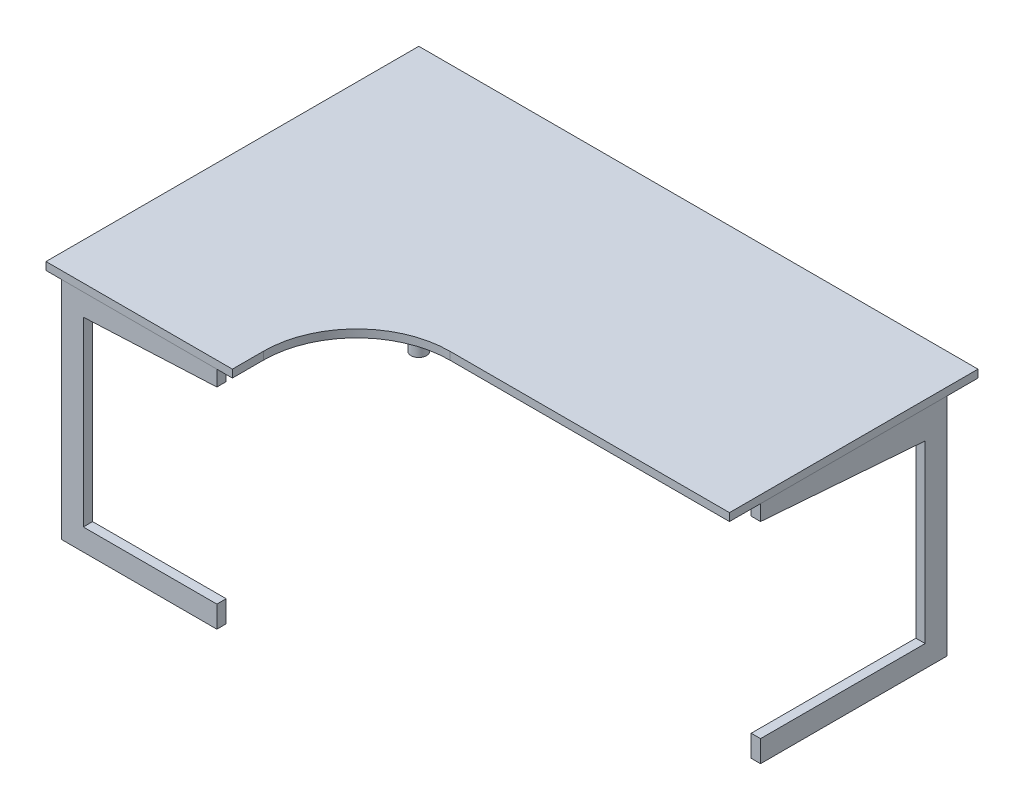
ISO-10303-21;
HEADER;
FILE_DESCRIPTION(('STEP AP214'),'2;1');
FILE_NAME('part.step','',(''),(''),'','','');
FILE_SCHEMA(('AUTOMOTIVE_DESIGN { 1 0 10303 214 1 1 1 1 }'));
ENDSEC;
DATA;
#1=APPLICATION_CONTEXT('core data for automotive mechanical design processes');
#2=APPLICATION_PROTOCOL_DEFINITION('international standard','automotive_design',2000,#1);
#3=PRODUCT_CONTEXT('',#1,'mechanical');
#4=PRODUCT('Part','Part','',(#3));
#5=PRODUCT_RELATED_PRODUCT_CATEGORY('part','',(#4));
#6=PRODUCT_DEFINITION_FORMATION('','',#4);
#7=PRODUCT_DEFINITION_CONTEXT('part definition',#1,'design');
#8=PRODUCT_DEFINITION('design','',#6,#7);
#9=PRODUCT_DEFINITION_SHAPE('','',#8);
#10=(LENGTH_UNIT() NAMED_UNIT(*) SI_UNIT(.MILLI.,.METRE.));
#11=(NAMED_UNIT(*) PLANE_ANGLE_UNIT() SI_UNIT($,.RADIAN.));
#12=(NAMED_UNIT(*) SI_UNIT($,.STERADIAN.) SOLID_ANGLE_UNIT());
#13=UNCERTAINTY_MEASURE_WITH_UNIT(LENGTH_MEASURE(1.E-05),#10,'distance_accuracy_value','');
#14=(GEOMETRIC_REPRESENTATION_CONTEXT(3) GLOBAL_UNCERTAINTY_ASSIGNED_CONTEXT((#13)) GLOBAL_UNIT_ASSIGNED_CONTEXT((#10,
#11,#12)) REPRESENTATION_CONTEXT('',''));
#15=CARTESIAN_POINT('',(0.,0.,0.));
#16=DIRECTION('',(0.,0.,1.));
#17=DIRECTION('',(1.,0.,0.));
#18=AXIS2_PLACEMENT_3D('',#15,#16,#17);
#19=CARTESIAN_POINT('',(-1250.,725.,1070.));
#20=DIRECTION('',(0.,1.,0.));
#21=DIRECTION('',(0.,0.,1.));
#22=AXIS2_PLACEMENT_3D('',#19,#20,#21);
#23=PLANE('',#22);
#24=DIRECTION('',(-1.,0.,0.));
#25=VECTOR('',#24,1.);
#26=CARTESIAN_POINT('',(-1250.,725.,1100.));
#27=LINE('',#26,#25);
#28=CARTESIAN_POINT('',(-1250.,725.,1100.));
#29=VERTEX_POINT('',#28);
#30=CARTESIAN_POINT('',(-1750.,725.,1100.));
#31=VERTEX_POINT('',#30);
#32=EDGE_CURVE('E138',#29,#31,#27,.T.);
#33=ORIENTED_EDGE('',*,*,#32,.F.);
#34=DIRECTION('',(0.,0.,1.));
#35=VECTOR('',#34,1.);
#36=CARTESIAN_POINT('',(-1250.,725.,1070.));
#37=LINE('',#36,#35);
#38=CARTESIAN_POINT('',(-1250.,725.,1070.));
#39=VERTEX_POINT('',#38);
#40=EDGE_CURVE('E12',#39,#29,#37,.T.);
#41=ORIENTED_EDGE('',*,*,#40,.F.);
#42=DIRECTION('',(-1.,0.,0.));
#43=VECTOR('',#42,1.);
#44=CARTESIAN_POINT('',(-1250.,725.,1070.));
#45=LINE('',#44,#43);
#46=CARTESIAN_POINT('',(-1750.,725.,1070.));
#47=VERTEX_POINT('',#46);
#48=EDGE_CURVE('E158',#39,#47,#45,.T.);
#49=ORIENTED_EDGE('',*,*,#48,.T.);
#50=DIRECTION('',(0.,0.,1.));
#51=VECTOR('',#50,1.);
#52=CARTESIAN_POINT('',(-1750.,725.,1070.));
#53=LINE('',#52,#51);
#54=EDGE_CURVE('E44',#47,#31,#53,.T.);
#55=ORIENTED_EDGE('',*,*,#54,.T.);
#56=EDGE_LOOP('',(#33,#41,#49,#55));
#57=FACE_BOUND('',#56,.T.);
#58=ADVANCED_FACE('F41',(#57),#23,.T.);
#59=CARTESIAN_POINT('',(-1250.,675.,1070.));
#60=DIRECTION('',(1.,0.,0.));
#61=DIRECTION('',(0.,1.,0.));
#62=AXIS2_PLACEMENT_3D('',#59,#60,#61);
#63=PLANE('',#62);
#64=DIRECTION('',(0.,1.,0.));
#65=VECTOR('',#64,1.);
#66=CARTESIAN_POINT('',(-1250.,675.,1100.));
#67=LINE('',#66,#65);
#68=CARTESIAN_POINT('',(-1250.,675.,1100.));
#69=VERTEX_POINT('',#68);
#70=EDGE_CURVE('E156',#69,#29,#67,.T.);
#71=ORIENTED_EDGE('',*,*,#70,.F.);
#72=DIRECTION('',(0.,0.,1.));
#73=VECTOR('',#72,1.);
#74=CARTESIAN_POINT('',(-1250.,675.,1070.));
#75=LINE('',#74,#73);
#76=CARTESIAN_POINT('',(-1250.,675.,1070.));
#77=VERTEX_POINT('',#76);
#78=EDGE_CURVE('E50',#77,#69,#75,.T.);
#79=ORIENTED_EDGE('',*,*,#78,.F.);
#80=DIRECTION('',(0.,1.,0.));
#81=VECTOR('',#80,1.);
#82=CARTESIAN_POINT('',(-1250.,675.,1070.));
#83=LINE('',#82,#81);
#84=EDGE_CURVE('E128',#77,#39,#83,.T.);
#85=ORIENTED_EDGE('',*,*,#84,.T.);
#86=ORIENTED_EDGE('',*,*,#40,.T.);
#87=EDGE_LOOP('',(#71,#79,#85,#86));
#88=FACE_BOUND('',#87,.T.);
#89=ADVANCED_FACE('F170',(#88),#63,.T.);
#90=CARTESIAN_POINT('',(-1680.,655.,1070.));
#91=DIRECTION('',(0.0464613993524679,-0.998920086078066,0.));
#92=DIRECTION('',(0.998920086078066,0.046461399352468,0.));
#93=AXIS2_PLACEMENT_3D('',#90,#91,#92);
#94=PLANE('',#93);
#95=DIRECTION('',(0.998920086078066,0.046461399352468,0.));
#96=VECTOR('',#95,1.);
#97=CARTESIAN_POINT('',(-1680.,655.,1100.));
#98=LINE('',#97,#96);
#99=CARTESIAN_POINT('',(-1680.,655.,1100.));
#100=VERTEX_POINT('',#99);
#101=EDGE_CURVE('E115',#100,#69,#98,.T.);
#102=ORIENTED_EDGE('',*,*,#101,.F.);
#103=DIRECTION('',(0.,0.,1.));
#104=VECTOR('',#103,1.);
#105=CARTESIAN_POINT('',(-1680.,655.,1070.));
#106=LINE('',#105,#104);
#107=CARTESIAN_POINT('',(-1680.,655.,1070.));
#108=VERTEX_POINT('',#107);
#109=EDGE_CURVE('E110',#108,#100,#106,.T.);
#110=ORIENTED_EDGE('',*,*,#109,.F.);
#111=DIRECTION('',(0.998920086078066,0.046461399352468,0.));
#112=VECTOR('',#111,1.);
#113=CARTESIAN_POINT('',(-1680.,655.,1070.));
#114=LINE('',#113,#112);
#115=EDGE_CURVE('E113',#108,#77,#114,.T.);
#116=ORIENTED_EDGE('',*,*,#115,.T.);
#117=ORIENTED_EDGE('',*,*,#78,.T.);
#118=EDGE_LOOP('',(#102,#110,#116,#117));
#119=FACE_BOUND('',#118,.T.);
#120=ADVANCED_FACE('F112',(#119),#94,.T.);
#121=CARTESIAN_POINT('',(-1680.,70.,1070.));
#122=DIRECTION('',(1.,0.,0.));
#123=DIRECTION('',(0.,1.,0.));
#124=AXIS2_PLACEMENT_3D('',#121,#122,#123);
#125=PLANE('',#124);
#126=DIRECTION('',(0.,1.,0.));
#127=VECTOR('',#126,1.);
#128=CARTESIAN_POINT('',(-1680.,70.,1100.));
#129=LINE('',#128,#127);
#130=CARTESIAN_POINT('',(-1680.,70.,1100.));
#131=VERTEX_POINT('',#130);
#132=EDGE_CURVE('E153',#131,#100,#129,.T.);
#133=ORIENTED_EDGE('',*,*,#132,.F.);
#134=DIRECTION('',(0.,0.,1.));
#135=VECTOR('',#134,1.);
#136=CARTESIAN_POINT('',(-1680.,70.,1070.));
#137=LINE('',#136,#135);
#138=CARTESIAN_POINT('',(-1680.,70.,1070.));
#139=VERTEX_POINT('',#138);
#140=EDGE_CURVE('E120',#139,#131,#137,.T.);
#141=ORIENTED_EDGE('',*,*,#140,.F.);
#142=DIRECTION('',(0.,1.,0.));
#143=VECTOR('',#142,1.);
#144=CARTESIAN_POINT('',(-1680.,70.,1070.));
#145=LINE('',#144,#143);
#146=EDGE_CURVE('E126',#139,#108,#145,.T.);
#147=ORIENTED_EDGE('',*,*,#146,.T.);
#148=ORIENTED_EDGE('',*,*,#109,.T.);
#149=EDGE_LOOP('',(#133,#141,#147,#148));
#150=FACE_BOUND('',#149,.T.);
#151=ADVANCED_FACE('F130',(#150),#125,.T.);
#152=CARTESIAN_POINT('',(-1250.,70.,1070.));
#153=DIRECTION('',(0.,1.,0.));
#154=DIRECTION('',(-1.,0.,0.));
#155=AXIS2_PLACEMENT_3D('',#152,#153,#154);
#156=PLANE('',#155);
#157=DIRECTION('',(-1.,0.,0.));
#158=VECTOR('',#157,1.);
#159=CARTESIAN_POINT('',(-1250.,70.,1100.));
#160=LINE('',#159,#158);
#161=CARTESIAN_POINT('',(-1250.,70.,1100.));
#162=VERTEX_POINT('',#161);
#163=EDGE_CURVE('E150',#162,#131,#160,.T.);
#164=ORIENTED_EDGE('',*,*,#163,.F.);
#165=DIRECTION('',(0.,0.,1.));
#166=VECTOR('',#165,1.);
#167=CARTESIAN_POINT('',(-1250.,70.,1070.));
#168=LINE('',#167,#166);
#169=CARTESIAN_POINT('',(-1250.,70.,1070.));
#170=VERTEX_POINT('',#169);
#171=EDGE_CURVE('E162',#170,#162,#168,.T.);
#172=ORIENTED_EDGE('',*,*,#171,.F.);
#173=DIRECTION('',(-1.,0.,0.));
#174=VECTOR('',#173,1.);
#175=CARTESIAN_POINT('',(-1250.,70.,1070.));
#176=LINE('',#175,#174);
#177=EDGE_CURVE('E131',#170,#139,#176,.T.);
#178=ORIENTED_EDGE('',*,*,#177,.T.);
#179=ORIENTED_EDGE('',*,*,#140,.T.);
#180=EDGE_LOOP('',(#164,#172,#178,#179));
#181=FACE_BOUND('',#180,.T.);
#182=ADVANCED_FACE('F183',(#181),#156,.T.);
#183=CARTESIAN_POINT('',(-1250.,0.,1070.));
#184=DIRECTION('',(1.,0.,0.));
#185=DIRECTION('',(0.,0.,-1.));
#186=AXIS2_PLACEMENT_3D('',#183,#184,#185);
#187=PLANE('',#186);
#188=DIRECTION('',(0.,1.,0.));
#189=VECTOR('',#188,1.);
#190=CARTESIAN_POINT('',(-1250.,0.,1100.));
#191=LINE('',#190,#189);
#192=CARTESIAN_POINT('',(-1250.,0.,1100.));
#193=VERTEX_POINT('',#192);
#194=EDGE_CURVE('E147',#193,#162,#191,.T.);
#195=ORIENTED_EDGE('',*,*,#194,.F.);
#196=DIRECTION('',(0.,0.,1.));
#197=VECTOR('',#196,1.);
#198=CARTESIAN_POINT('',(-1250.,0.,1070.));
#199=LINE('',#198,#197);
#200=CARTESIAN_POINT('',(-1250.,0.,1070.));
#201=VERTEX_POINT('',#200);
#202=EDGE_CURVE('E164',#201,#193,#199,.T.);
#203=ORIENTED_EDGE('',*,*,#202,.F.);
#204=DIRECTION('',(0.,1.,0.));
#205=VECTOR('',#204,1.);
#206=CARTESIAN_POINT('',(-1250.,0.,1070.));
#207=LINE('',#206,#205);
#208=EDGE_CURVE('E133',#201,#170,#207,.T.);
#209=ORIENTED_EDGE('',*,*,#208,.T.);
#210=ORIENTED_EDGE('',*,*,#171,.T.);
#211=EDGE_LOOP('',(#195,#203,#209,#210));
#212=FACE_BOUND('',#211,.T.);
#213=ADVANCED_FACE('F186',(#212),#187,.T.);
#214=CARTESIAN_POINT('',(-1750.,0.,1070.));
#215=DIRECTION('',(0.,-1.,0.));
#216=DIRECTION('',(1.,0.,0.));
#217=AXIS2_PLACEMENT_3D('',#214,#215,#216);
#218=PLANE('',#217);
#219=DIRECTION('',(1.,0.,0.));
#220=VECTOR('',#219,1.);
#221=CARTESIAN_POINT('',(-1750.,0.,1100.));
#222=LINE('',#221,#220);
#223=CARTESIAN_POINT('',(-1750.,0.,1100.));
#224=VERTEX_POINT('',#223);
#225=EDGE_CURVE('E144',#224,#193,#222,.T.);
#226=ORIENTED_EDGE('',*,*,#225,.F.);
#227=DIRECTION('',(0.,0.,1.));
#228=VECTOR('',#227,1.);
#229=CARTESIAN_POINT('',(-1750.,0.,1070.));
#230=LINE('',#229,#228);
#231=CARTESIAN_POINT('',(-1750.,0.,1070.));
#232=VERTEX_POINT('',#231);
#233=EDGE_CURVE('E165',#232,#224,#230,.T.);
#234=ORIENTED_EDGE('',*,*,#233,.F.);
#235=DIRECTION('',(1.,0.,0.));
#236=VECTOR('',#235,1.);
#237=CARTESIAN_POINT('',(-1750.,0.,1070.));
#238=LINE('',#237,#236);
#239=EDGE_CURVE('E261',#232,#201,#238,.T.);
#240=ORIENTED_EDGE('',*,*,#239,.T.);
#241=ORIENTED_EDGE('',*,*,#202,.T.);
#242=EDGE_LOOP('',(#226,#234,#240,#241));
#243=FACE_BOUND('',#242,.T.);
#244=ADVANCED_FACE('F190',(#243),#218,.T.);
#245=CARTESIAN_POINT('',(-1750.,725.,1070.));
#246=DIRECTION('',(-1.,0.,0.));
#247=DIRECTION('',(0.,-1.,0.));
#248=AXIS2_PLACEMENT_3D('',#245,#246,#247);
#249=PLANE('',#248);
#250=DIRECTION('',(0.,-1.,0.));
#251=VECTOR('',#250,1.);
#252=CARTESIAN_POINT('',(-1750.,725.,1100.));
#253=LINE('',#252,#251);
#254=EDGE_CURVE('E141',#31,#224,#253,.T.);
#255=ORIENTED_EDGE('',*,*,#254,.F.);
#256=ORIENTED_EDGE('',*,*,#54,.F.);
#257=DIRECTION('',(0.,-1.,0.));
#258=VECTOR('',#257,1.);
#259=CARTESIAN_POINT('',(-1750.,725.,1070.));
#260=LINE('',#259,#258);
#261=EDGE_CURVE('E262',#47,#232,#260,.T.);
#262=ORIENTED_EDGE('',*,*,#261,.T.);
#263=ORIENTED_EDGE('',*,*,#233,.T.);
#264=EDGE_LOOP('',(#255,#256,#262,#263));
#265=FACE_BOUND('',#264,.T.);
#266=ADVANCED_FACE('F167',(#265),#249,.T.);
#267=CARTESIAN_POINT('',(-1250.,725.,1070.));
#268=DIRECTION('',(0.,0.,-1.));
#269=DIRECTION('',(-1.,0.,0.));
#270=AXIS2_PLACEMENT_3D('',#267,#268,#269);
#271=PLANE('',#270);
#272=ORIENTED_EDGE('',*,*,#48,.F.);
#273=ORIENTED_EDGE('',*,*,#84,.F.);
#274=ORIENTED_EDGE('',*,*,#115,.F.);
#275=ORIENTED_EDGE('',*,*,#146,.F.);
#276=ORIENTED_EDGE('',*,*,#177,.F.);
#277=ORIENTED_EDGE('',*,*,#208,.F.);
#278=ORIENTED_EDGE('',*,*,#239,.F.);
#279=ORIENTED_EDGE('',*,*,#261,.F.);
#280=EDGE_LOOP('',(#272,#273,#274,#275,#276,#277,#278,#279));
#281=FACE_BOUND('',#280,.T.);
#282=ADVANCED_FACE('F124',(#281),#271,.T.);
#283=CARTESIAN_POINT('',(-1250.,725.,1100.));
#284=DIRECTION('',(0.,0.,-1.));
#285=DIRECTION('',(-1.,0.,0.));
#286=AXIS2_PLACEMENT_3D('',#283,#284,#285);
#287=PLANE('',#286);
#288=ORIENTED_EDGE('',*,*,#32,.T.);
#289=ORIENTED_EDGE('',*,*,#254,.T.);
#290=ORIENTED_EDGE('',*,*,#225,.T.);
#291=ORIENTED_EDGE('',*,*,#194,.T.);
#292=ORIENTED_EDGE('',*,*,#163,.T.);
#293=ORIENTED_EDGE('',*,*,#132,.T.);
#294=ORIENTED_EDGE('',*,*,#101,.T.);
#295=ORIENTED_EDGE('',*,*,#70,.T.);
#296=EDGE_LOOP('',(#288,#289,#290,#291,#292,#293,#294,#295));
#297=FACE_BOUND('',#296,.T.);
#298=ADVANCED_FACE('F169',(#297),#287,.F.);
#299=CLOSED_SHELL('',(#58,#89,#120,#151,#182,#213,#244,#266,#282,#298));
#300=MANIFOLD_SOLID_BREP('B2',#299);
#301=CARTESIAN_POINT('',(-900.,725.,1000.));
#302=DIRECTION('',(0.,1.,0.));
#303=DIRECTION('',(0.,0.,1.));
#304=AXIS2_PLACEMENT_3D('',#301,#302,#303);
#305=PLANE('',#304);
#306=DIRECTION('',(0.,0.,-1.));
#307=VECTOR('',#306,1.);
#308=CARTESIAN_POINT('',(0.,725.,-99.9999999999999));
#309=LINE('',#308,#307);
#310=CARTESIAN_POINT('',(0.,725.,700.));
#311=VERTEX_POINT('',#310);
#312=CARTESIAN_POINT('',(0.,725.,-99.9999999999999));
#313=VERTEX_POINT('',#312);
#314=EDGE_CURVE('E369',#311,#313,#309,.T.);
#315=ORIENTED_EDGE('',*,*,#314,.F.);
#316=DIRECTION('',(1.,0.,0.));
#317=VECTOR('',#316,1.);
#318=CARTESIAN_POINT('',(0.,725.,700.));
#319=LINE('',#318,#317);
#320=CARTESIAN_POINT('',(-900.,725.,700.));
#321=VERTEX_POINT('',#320);
#322=EDGE_CURVE('E326',#321,#311,#319,.T.);
#323=ORIENTED_EDGE('',*,*,#322,.F.);
#324=CARTESIAN_POINT('',(-900.,725.,1000.));
#325=DIRECTION('',(0.,-1.,0.));
#326=DIRECTION('',(0.,0.,1.));
#327=AXIS2_PLACEMENT_3D('',#324,#325,#326);
#328=CIRCLE('',#327,300.);
#329=CARTESIAN_POINT('',(-1200.,725.,1000.));
#330=VERTEX_POINT('',#329);
#331=EDGE_CURVE('E320',#330,#321,#328,.T.);
#332=ORIENTED_EDGE('',*,*,#331,.F.);
#333=DIRECTION('',(0.,0.,-1.));
#334=VECTOR('',#333,1.);
#335=CARTESIAN_POINT('',(-1200.,725.,1100.));
#336=LINE('',#335,#334);
#337=CARTESIAN_POINT('',(-1200.,725.,1100.));
#338=VERTEX_POINT('',#337);
#339=EDGE_CURVE('E359',#338,#330,#336,.T.);
#340=ORIENTED_EDGE('',*,*,#339,.F.);
#341=DIRECTION('',(1.,0.,0.));
#342=VECTOR('',#341,1.);
#343=CARTESIAN_POINT('',(-1800.,725.,1100.));
#344=LINE('',#343,#342);
#345=CARTESIAN_POINT('',(-1800.,725.,1100.));
#346=VERTEX_POINT('',#345);
#347=EDGE_CURVE('E377',#346,#338,#344,.T.);
#348=ORIENTED_EDGE('',*,*,#347,.F.);
#349=DIRECTION('',(0.,0.,1.));
#350=VECTOR('',#349,1.);
#351=CARTESIAN_POINT('',(-1800.,725.,-99.9999999999999));
#352=LINE('',#351,#350);
#353=CARTESIAN_POINT('',(-1800.,725.,-99.9999999999999));
#354=VERTEX_POINT('',#353);
#355=EDGE_CURVE('E375',#354,#346,#352,.T.);
#356=ORIENTED_EDGE('',*,*,#355,.F.);
#357=DIRECTION('',(-1.,0.,0.));
#358=VECTOR('',#357,1.);
#359=CARTESIAN_POINT('',(0.,725.,-99.9999999999999));
#360=LINE('',#359,#358);
#361=EDGE_CURVE('E372',#313,#354,#360,.T.);
#362=ORIENTED_EDGE('',*,*,#361,.F.);
#363=EDGE_LOOP('',(#315,#323,#332,#340,#348,#356,#362));
#364=FACE_BOUND('',#363,.T.);
#365=CARTESIAN_POINT('',(-1700.,725.,0.));
#366=DIRECTION('',(0.,1.,0.));
#367=DIRECTION('',(0.,0.,1.));
#368=AXIS2_PLACEMENT_3D('',#365,#366,#367);
#369=CIRCLE('',#368,25.);
#370=CARTESIAN_POINT('',(-1700.,725.,25.));
#371=VERTEX_POINT('',#370);
#372=EDGE_CURVE('E39',#371,#371,#369,.F.);
#373=ORIENTED_EDGE('',*,*,#372,.F.);
#374=EDGE_LOOP('',(#373));
#375=FACE_BOUND('',#374,.T.);
#376=ADVANCED_FACE('F277',(#364,#375),#305,.F.);
#377=CARTESIAN_POINT('',(0.,750.,-99.9999999999999));
#378=DIRECTION('',(-1.,0.,0.));
#379=DIRECTION('',(0.,0.,1.));
#380=AXIS2_PLACEMENT_3D('',#377,#378,#379);
#381=PLANE('',#380);
#382=ORIENTED_EDGE('',*,*,#314,.T.);
#383=DIRECTION('',(0.,-1.,0.));
#384=VECTOR('',#383,1.);
#385=CARTESIAN_POINT('',(0.,750.,-99.9999999999999));
#386=LINE('',#385,#384);
#387=CARTESIAN_POINT('',(0.,750.,-99.9999999999999));
#388=VERTEX_POINT('',#387);
#389=EDGE_CURVE('E286',#388,#313,#386,.T.);
#390=ORIENTED_EDGE('',*,*,#389,.F.);
#391=DIRECTION('',(0.,0.,-1.));
#392=VECTOR('',#391,1.);
#393=CARTESIAN_POINT('',(0.,750.,-99.9999999999999));
#394=LINE('',#393,#392);
#395=CARTESIAN_POINT('',(0.,750.,700.));
#396=VERTEX_POINT('',#395);
#397=EDGE_CURVE('E382',#396,#388,#394,.T.);
#398=ORIENTED_EDGE('',*,*,#397,.F.);
#399=DIRECTION('',(0.,-1.,0.));
#400=VECTOR('',#399,1.);
#401=CARTESIAN_POINT('',(0.,750.,700.));
#402=LINE('',#401,#400);
#403=EDGE_CURVE('E365',#396,#311,#402,.T.);
#404=ORIENTED_EDGE('',*,*,#403,.T.);
#405=EDGE_LOOP('',(#382,#390,#398,#404));
#406=FACE_BOUND('',#405,.T.);
#407=ADVANCED_FACE('F279',(#406),#381,.F.);
#408=CARTESIAN_POINT('',(0.,750.,-99.9999999999999));
#409=DIRECTION('',(0.,0.,1.));
#410=DIRECTION('',(1.,0.,0.));
#411=AXIS2_PLACEMENT_3D('',#408,#409,#410);
#412=PLANE('',#411);
#413=ORIENTED_EDGE('',*,*,#361,.T.);
#414=DIRECTION('',(0.,-1.,0.));
#415=VECTOR('',#414,1.);
#416=CARTESIAN_POINT('',(-1800.,750.,-99.9999999999999));
#417=LINE('',#416,#415);
#418=CARTESIAN_POINT('',(-1800.,750.,-99.9999999999999));
#419=VERTEX_POINT('',#418);
#420=EDGE_CURVE('E389',#419,#354,#417,.T.);
#421=ORIENTED_EDGE('',*,*,#420,.F.);
#422=DIRECTION('',(-1.,0.,0.));
#423=VECTOR('',#422,1.);
#424=CARTESIAN_POINT('',(0.,750.,-99.9999999999999));
#425=LINE('',#424,#423);
#426=EDGE_CURVE('E335',#388,#419,#425,.T.);
#427=ORIENTED_EDGE('',*,*,#426,.F.);
#428=ORIENTED_EDGE('',*,*,#389,.T.);
#429=EDGE_LOOP('',(#413,#421,#427,#428));
#430=FACE_BOUND('',#429,.T.);
#431=ADVANCED_FACE('F392',(#430),#412,.F.);
#432=CARTESIAN_POINT('',(-1800.,750.,-99.9999999999999));
#433=DIRECTION('',(1.,0.,0.));
#434=DIRECTION('',(0.,0.,-1.));
#435=AXIS2_PLACEMENT_3D('',#432,#433,#434);
#436=PLANE('',#435);
#437=ORIENTED_EDGE('',*,*,#355,.T.);
#438=DIRECTION('',(0.,-1.,0.));
#439=VECTOR('',#438,1.);
#440=CARTESIAN_POINT('',(-1800.,750.,1100.));
#441=LINE('',#440,#439);
#442=CARTESIAN_POINT('',(-1800.,750.,1100.));
#443=VERTEX_POINT('',#442);
#444=EDGE_CURVE('E386',#443,#346,#441,.T.);
#445=ORIENTED_EDGE('',*,*,#444,.F.);
#446=DIRECTION('',(0.,0.,1.));
#447=VECTOR('',#446,1.);
#448=CARTESIAN_POINT('',(-1800.,750.,-99.9999999999999));
#449=LINE('',#448,#447);
#450=EDGE_CURVE('E406',#419,#443,#449,.T.);
#451=ORIENTED_EDGE('',*,*,#450,.F.);
#452=ORIENTED_EDGE('',*,*,#420,.T.);
#453=EDGE_LOOP('',(#437,#445,#451,#452));
#454=FACE_BOUND('',#453,.T.);
#455=ADVANCED_FACE('F402',(#454),#436,.F.);
#456=CARTESIAN_POINT('',(-1800.,750.,1100.));
#457=DIRECTION('',(0.,0.,-1.));
#458=DIRECTION('',(-1.,0.,0.));
#459=AXIS2_PLACEMENT_3D('',#456,#457,#458);
#460=PLANE('',#459);
#461=ORIENTED_EDGE('',*,*,#347,.T.);
#462=DIRECTION('',(0.,-1.,0.));
#463=VECTOR('',#462,1.);
#464=CARTESIAN_POINT('',(-1200.,750.,1100.));
#465=LINE('',#464,#463);
#466=CARTESIAN_POINT('',(-1200.,750.,1100.));
#467=VERTEX_POINT('',#466);
#468=EDGE_CURVE('E360',#467,#338,#465,.T.);
#469=ORIENTED_EDGE('',*,*,#468,.F.);
#470=DIRECTION('',(1.,0.,0.));
#471=VECTOR('',#470,1.);
#472=CARTESIAN_POINT('',(-1800.,750.,1100.));
#473=LINE('',#472,#471);
#474=EDGE_CURVE('E351',#443,#467,#473,.T.);
#475=ORIENTED_EDGE('',*,*,#474,.F.);
#476=ORIENTED_EDGE('',*,*,#444,.T.);
#477=EDGE_LOOP('',(#461,#469,#475,#476));
#478=FACE_BOUND('',#477,.T.);
#479=ADVANCED_FACE('F405',(#478),#460,.F.);
#480=CARTESIAN_POINT('',(-1200.,750.,1100.));
#481=DIRECTION('',(-1.,0.,0.));
#482=DIRECTION('',(0.,0.,1.));
#483=AXIS2_PLACEMENT_3D('',#480,#481,#482);
#484=PLANE('',#483);
#485=ORIENTED_EDGE('',*,*,#339,.T.);
#486=DIRECTION('',(0.,-1.,0.));
#487=VECTOR('',#486,1.);
#488=CARTESIAN_POINT('',(-1200.,750.,1000.));
#489=LINE('',#488,#487);
#490=CARTESIAN_POINT('',(-1200.,750.,1000.));
#491=VERTEX_POINT('',#490);
#492=EDGE_CURVE('E356',#491,#330,#489,.T.);
#493=ORIENTED_EDGE('',*,*,#492,.F.);
#494=DIRECTION('',(0.,0.,-1.));
#495=VECTOR('',#494,1.);
#496=CARTESIAN_POINT('',(-1200.,750.,1100.));
#497=LINE('',#496,#495);
#498=EDGE_CURVE('E345',#467,#491,#497,.T.);
#499=ORIENTED_EDGE('',*,*,#498,.F.);
#500=ORIENTED_EDGE('',*,*,#468,.T.);
#501=EDGE_LOOP('',(#485,#493,#499,#500));
#502=FACE_BOUND('',#501,.T.);
#503=ADVANCED_FACE('F357',(#502),#484,.F.);
#504=CARTESIAN_POINT('',(-900.,750.,1000.));
#505=DIRECTION('',(0.,-1.,0.));
#506=DIRECTION('',(0.,0.,-1.));
#507=AXIS2_PLACEMENT_3D('',#504,#505,#506);
#508=CYLINDRICAL_SURFACE('',#507,300.);
#509=ORIENTED_EDGE('',*,*,#331,.T.);
#510=DIRECTION('',(0.,-1.,0.));
#511=VECTOR('',#510,1.);
#512=CARTESIAN_POINT('',(-900.,750.,700.));
#513=LINE('',#512,#511);
#514=CARTESIAN_POINT('',(-900.,750.,700.));
#515=VERTEX_POINT('',#514);
#516=EDGE_CURVE('E361',#515,#321,#513,.T.);
#517=ORIENTED_EDGE('',*,*,#516,.F.);
#518=CARTESIAN_POINT('',(-900.,750.,1000.));
#519=DIRECTION('',(0.,-1.,0.));
#520=DIRECTION('',(0.,0.,1.));
#521=AXIS2_PLACEMENT_3D('',#518,#519,#520);
#522=CIRCLE('',#521,300.);
#523=EDGE_CURVE('E349',#491,#515,#522,.T.);
#524=ORIENTED_EDGE('',*,*,#523,.F.);
#525=ORIENTED_EDGE('',*,*,#492,.T.);
#526=EDGE_LOOP('',(#509,#517,#524,#525));
#527=FACE_BOUND('',#526,.T.);
#528=ADVANCED_FACE('F363',(#527),#508,.F.);
#529=CARTESIAN_POINT('',(0.,750.,700.));
#530=DIRECTION('',(0.,0.,-1.));
#531=DIRECTION('',(-1.,0.,0.));
#532=AXIS2_PLACEMENT_3D('',#529,#530,#531);
#533=PLANE('',#532);
#534=ORIENTED_EDGE('',*,*,#322,.T.);
#535=ORIENTED_EDGE('',*,*,#403,.F.);
#536=DIRECTION('',(1.,0.,0.));
#537=VECTOR('',#536,1.);
#538=CARTESIAN_POINT('',(0.,750.,700.));
#539=LINE('',#538,#537);
#540=EDGE_CURVE('E294',#515,#396,#539,.T.);
#541=ORIENTED_EDGE('',*,*,#540,.F.);
#542=ORIENTED_EDGE('',*,*,#516,.T.);
#543=EDGE_LOOP('',(#534,#535,#541,#542));
#544=FACE_BOUND('',#543,.T.);
#545=ADVANCED_FACE('F431',(#544),#533,.F.);
#546=CARTESIAN_POINT('',(-900.,750.,1000.));
#547=DIRECTION('',(0.,1.,0.));
#548=DIRECTION('',(0.,0.,1.));
#549=AXIS2_PLACEMENT_3D('',#546,#547,#548);
#550=PLANE('',#549);
#551=ORIENTED_EDGE('',*,*,#397,.T.);
#552=ORIENTED_EDGE('',*,*,#426,.T.);
#553=ORIENTED_EDGE('',*,*,#450,.T.);
#554=ORIENTED_EDGE('',*,*,#474,.T.);
#555=ORIENTED_EDGE('',*,*,#498,.T.);
#556=ORIENTED_EDGE('',*,*,#523,.T.);
#557=ORIENTED_EDGE('',*,*,#540,.T.);
#558=EDGE_LOOP('',(#551,#552,#553,#554,#555,#556,#557));
#559=FACE_BOUND('',#558,.T.);
#560=ADVANCED_FACE('F347',(#559),#550,.T.);
#561=CARTESIAN_POINT('',(-1700.,795.710678118655,0.));
#562=DIRECTION('',(0.,-1.,0.));
#563=DIRECTION('',(0.,0.,-1.));
#564=AXIS2_PLACEMENT_3D('',#561,#562,#563);
#565=CYLINDRICAL_SURFACE('',#564,25.);
#566=CARTESIAN_POINT('',(-1700.,0.,0.));
#567=DIRECTION('',(0.,1.,0.));
#568=DIRECTION('',(0.,0.,1.));
#569=AXIS2_PLACEMENT_3D('',#566,#567,#568);
#570=CIRCLE('',#569,25.);
#571=CARTESIAN_POINT('',(-1700.,0.,25.));
#572=VERTEX_POINT('',#571);
#573=EDGE_CURVE('E373',#572,#572,#570,.T.);
#574=ORIENTED_EDGE('',*,*,#573,.T.);
#575=EDGE_LOOP('',(#574));
#576=FACE_BOUND('',#575,.T.);
#577=ORIENTED_EDGE('',*,*,#372,.T.);
#578=EDGE_LOOP('',(#577));
#579=FACE_BOUND('',#578,.T.);
#580=ADVANCED_FACE('F414',(#576,#579),#565,.T.);
#581=CARTESIAN_POINT('',(-1700.,0.,0.));
#582=DIRECTION('',(0.,1.,0.));
#583=DIRECTION('',(0.,0.,1.));
#584=AXIS2_PLACEMENT_3D('',#581,#582,#583);
#585=PLANE('',#584);
#586=ORIENTED_EDGE('',*,*,#573,.F.);
#587=EDGE_LOOP('',(#586));
#588=FACE_BOUND('',#587,.T.);
#589=ADVANCED_FACE('F417',(#588),#585,.F.);
#590=CLOSED_SHELL('',(#376,#407,#431,#455,#479,#503,#528,#545,#560,#580,#589));
#591=MANIFOLD_SOLID_BREP('B6',#590);
#592=CARTESIAN_POINT('',(-30.,725.,0.));
#593=DIRECTION('',(0.,0.,-1.));
#594=DIRECTION('',(0.,1.,0.));
#595=AXIS2_PLACEMENT_3D('',#592,#593,#594);
#596=PLANE('',#595);
#597=DIRECTION('',(0.,1.,0.));
#598=VECTOR('',#597,1.);
#599=CARTESIAN_POINT('',(0.,725.,0.));
#600=LINE('',#599,#598);
#601=CARTESIAN_POINT('',(0.,0.,0.));
#602=VERTEX_POINT('',#601);
#603=CARTESIAN_POINT('',(0.,725.,0.));
#604=VERTEX_POINT('',#603);
#605=EDGE_CURVE('E605',#602,#604,#600,.T.);
#606=ORIENTED_EDGE('',*,*,#605,.F.);
#607=DIRECTION('',(1.,0.,0.));
#608=VECTOR('',#607,1.);
#609=CARTESIAN_POINT('',(-30.,0.,0.));
#610=LINE('',#609,#608);
#611=CARTESIAN_POINT('',(-30.,0.,0.));
#612=VERTEX_POINT('',#611);
#613=EDGE_CURVE('E275',#612,#602,#610,.T.);
#614=ORIENTED_EDGE('',*,*,#613,.F.);
#615=DIRECTION('',(0.,1.,0.));
#616=VECTOR('',#615,1.);
#617=CARTESIAN_POINT('',(-30.,725.,0.));
#618=LINE('',#617,#616);
#619=CARTESIAN_POINT('',(-30.,725.,0.));
#620=VERTEX_POINT('',#619);
#621=EDGE_CURVE('E625',#612,#620,#618,.T.);
#622=ORIENTED_EDGE('',*,*,#621,.T.);
#623=DIRECTION('',(1.,0.,0.));
#624=VECTOR('',#623,1.);
#625=CARTESIAN_POINT('',(-30.,725.,0.));
#626=LINE('',#625,#624);
#627=EDGE_CURVE('E511',#620,#604,#626,.T.);
#628=ORIENTED_EDGE('',*,*,#627,.T.);
#629=EDGE_LOOP('',(#606,#614,#622,#628));
#630=FACE_BOUND('',#629,.T.);
#631=ADVANCED_FACE('F508',(#630),#596,.T.);
#632=CARTESIAN_POINT('',(-30.,0.,0.));
#633=DIRECTION('',(0.,-1.,0.));
#634=DIRECTION('',(0.,0.,-1.));
#635=AXIS2_PLACEMENT_3D('',#632,#633,#634);
#636=PLANE('',#635);
#637=DIRECTION('',(0.,0.,-1.));
#638=VECTOR('',#637,1.);
#639=CARTESIAN_POINT('',(0.,0.,0.));
#640=LINE('',#639,#638);
#641=CARTESIAN_POINT('',(0.,0.,600.));
#642=VERTEX_POINT('',#641);
#643=EDGE_CURVE('E623',#642,#602,#640,.T.);
#644=ORIENTED_EDGE('',*,*,#643,.F.);
#645=DIRECTION('',(1.,0.,0.));
#646=VECTOR('',#645,1.);
#647=CARTESIAN_POINT('',(-30.,0.,600.));
#648=LINE('',#647,#646);
#649=CARTESIAN_POINT('',(-30.,0.,600.));
#650=VERTEX_POINT('',#649);
#651=EDGE_CURVE('E517',#650,#642,#648,.T.);
#652=ORIENTED_EDGE('',*,*,#651,.F.);
#653=DIRECTION('',(0.,0.,-1.));
#654=VECTOR('',#653,1.);
#655=CARTESIAN_POINT('',(-30.,0.,0.));
#656=LINE('',#655,#654);
#657=EDGE_CURVE('E595',#650,#612,#656,.T.);
#658=ORIENTED_EDGE('',*,*,#657,.T.);
#659=ORIENTED_EDGE('',*,*,#613,.T.);
#660=EDGE_LOOP('',(#644,#652,#658,#659));
#661=FACE_BOUND('',#660,.T.);
#662=ADVANCED_FACE('F637',(#661),#636,.T.);
#663=CARTESIAN_POINT('',(-30.,0.,600.));
#664=DIRECTION('',(0.,0.,1.));
#665=DIRECTION('',(1.,0.,0.));
#666=AXIS2_PLACEMENT_3D('',#663,#664,#665);
#667=PLANE('',#666);
#668=DIRECTION('',(0.,-1.,0.));
#669=VECTOR('',#668,1.);
#670=CARTESIAN_POINT('',(0.,0.,600.));
#671=LINE('',#670,#669);
#672=CARTESIAN_POINT('',(0.,69.9999999999999,600.));
#673=VERTEX_POINT('',#672);
#674=EDGE_CURVE('E582',#673,#642,#671,.T.);
#675=ORIENTED_EDGE('',*,*,#674,.F.);
#676=DIRECTION('',(1.,0.,0.));
#677=VECTOR('',#676,1.);
#678=CARTESIAN_POINT('',(-30.,69.9999999999999,600.));
#679=LINE('',#678,#677);
#680=CARTESIAN_POINT('',(-30.,69.9999999999999,600.));
#681=VERTEX_POINT('',#680);
#682=EDGE_CURVE('E577',#681,#673,#679,.T.);
#683=ORIENTED_EDGE('',*,*,#682,.F.);
#684=DIRECTION('',(0.,-1.,0.));
#685=VECTOR('',#684,1.);
#686=CARTESIAN_POINT('',(-30.,0.,600.));
#687=LINE('',#686,#685);
#688=EDGE_CURVE('E580',#681,#650,#687,.T.);
#689=ORIENTED_EDGE('',*,*,#688,.T.);
#690=ORIENTED_EDGE('',*,*,#651,.T.);
#691=EDGE_LOOP('',(#675,#683,#689,#690));
#692=FACE_BOUND('',#691,.T.);
#693=ADVANCED_FACE('F579',(#692),#667,.T.);
#694=CARTESIAN_POINT('',(-30.,69.9999999999999,600.));
#695=DIRECTION('',(0.,1.,0.));
#696=DIRECTION('',(0.,0.,1.));
#697=AXIS2_PLACEMENT_3D('',#694,#695,#696);
#698=PLANE('',#697);
#699=DIRECTION('',(0.,0.,1.));
#700=VECTOR('',#699,1.);
#701=CARTESIAN_POINT('',(0.,69.9999999999999,600.));
#702=LINE('',#701,#700);
#703=CARTESIAN_POINT('',(0.,69.9999999999999,70.));
#704=VERTEX_POINT('',#703);
#705=EDGE_CURVE('E620',#704,#673,#702,.T.);
#706=ORIENTED_EDGE('',*,*,#705,.F.);
#707=DIRECTION('',(1.,0.,0.));
#708=VECTOR('',#707,1.);
#709=CARTESIAN_POINT('',(-30.,69.9999999999999,70.));
#710=LINE('',#709,#708);
#711=CARTESIAN_POINT('',(-30.,69.9999999999999,70.));
#712=VERTEX_POINT('',#711);
#713=EDGE_CURVE('E587',#712,#704,#710,.T.);
#714=ORIENTED_EDGE('',*,*,#713,.F.);
#715=DIRECTION('',(0.,0.,1.));
#716=VECTOR('',#715,1.);
#717=CARTESIAN_POINT('',(-30.,69.9999999999999,600.));
#718=LINE('',#717,#716);
#719=EDGE_CURVE('E593',#712,#681,#718,.T.);
#720=ORIENTED_EDGE('',*,*,#719,.T.);
#721=ORIENTED_EDGE('',*,*,#682,.T.);
#722=EDGE_LOOP('',(#706,#714,#720,#721));
#723=FACE_BOUND('',#722,.T.);
#724=ADVANCED_FACE('F597',(#723),#698,.T.);
#725=CARTESIAN_POINT('',(-30.,69.9999999999999,70.));
#726=DIRECTION('',(0.,0.,1.));
#727=DIRECTION('',(1.,0.,0.));
#728=AXIS2_PLACEMENT_3D('',#725,#726,#727);
#729=PLANE('',#728);
#730=DIRECTION('',(0.,-1.,0.));
#731=VECTOR('',#730,1.);
#732=CARTESIAN_POINT('',(0.,69.9999999999999,70.));
#733=LINE('',#732,#731);
#734=CARTESIAN_POINT('',(0.,635.,70.));
#735=VERTEX_POINT('',#734);
#736=EDGE_CURVE('E617',#735,#704,#733,.T.);
#737=ORIENTED_EDGE('',*,*,#736,.F.);
#738=DIRECTION('',(1.,0.,0.));
#739=VECTOR('',#738,1.);
#740=CARTESIAN_POINT('',(-30.,635.,70.));
#741=LINE('',#740,#739);
#742=CARTESIAN_POINT('',(-30.,635.,70.));
#743=VERTEX_POINT('',#742);
#744=EDGE_CURVE('E629',#743,#735,#741,.T.);
#745=ORIENTED_EDGE('',*,*,#744,.F.);
#746=DIRECTION('',(0.,-1.,0.));
#747=VECTOR('',#746,1.);
#748=CARTESIAN_POINT('',(-30.,69.9999999999999,70.));
#749=LINE('',#748,#747);
#750=EDGE_CURVE('E598',#743,#712,#749,.T.);
#751=ORIENTED_EDGE('',*,*,#750,.T.);
#752=ORIENTED_EDGE('',*,*,#713,.T.);
#753=EDGE_LOOP('',(#737,#745,#751,#752));
#754=FACE_BOUND('',#753,.T.);
#755=ADVANCED_FACE('F650',(#754),#729,.T.);
#756=CARTESIAN_POINT('',(-30.,635.,70.));
#757=DIRECTION('',(0.,-0.997164120486613,0.0752576694706876));
#758=DIRECTION('',(0.,-0.0752576694706876,-0.997164120486613));
#759=AXIS2_PLACEMENT_3D('',#756,#757,#758);
#760=PLANE('',#759);
#761=DIRECTION('',(0.,-0.0752576694706876,-0.997164120486613));
#762=VECTOR('',#761,1.);
#763=CARTESIAN_POINT('',(0.,635.,70.));
#764=LINE('',#763,#762);
#765=CARTESIAN_POINT('',(0.,675.,600.));
#766=VERTEX_POINT('',#765);
#767=EDGE_CURVE('E614',#766,#735,#764,.T.);
#768=ORIENTED_EDGE('',*,*,#767,.F.);
#769=DIRECTION('',(1.,0.,0.));
#770=VECTOR('',#769,1.);
#771=CARTESIAN_POINT('',(-30.,675.,600.));
#772=LINE('',#771,#770);
#773=CARTESIAN_POINT('',(-30.,675.,600.));
#774=VERTEX_POINT('',#773);
#775=EDGE_CURVE('E631',#774,#766,#772,.T.);
#776=ORIENTED_EDGE('',*,*,#775,.F.);
#777=DIRECTION('',(0.,-0.0752576694706876,-0.997164120486613));
#778=VECTOR('',#777,1.);
#779=CARTESIAN_POINT('',(-30.,635.,70.));
#780=LINE('',#779,#778);
#781=EDGE_CURVE('E600',#774,#743,#780,.T.);
#782=ORIENTED_EDGE('',*,*,#781,.T.);
#783=ORIENTED_EDGE('',*,*,#744,.T.);
#784=EDGE_LOOP('',(#768,#776,#782,#783));
#785=FACE_BOUND('',#784,.T.);
#786=ADVANCED_FACE('F653',(#785),#760,.T.);
#787=CARTESIAN_POINT('',(-30.,675.,600.));
#788=DIRECTION('',(0.,0.,1.));
#789=DIRECTION('',(1.,0.,0.));
#790=AXIS2_PLACEMENT_3D('',#787,#788,#789);
#791=PLANE('',#790);
#792=DIRECTION('',(0.,-1.,0.));
#793=VECTOR('',#792,1.);
#794=CARTESIAN_POINT('',(0.,675.,600.));
#795=LINE('',#794,#793);
#796=CARTESIAN_POINT('',(0.,725.,600.));
#797=VERTEX_POINT('',#796);
#798=EDGE_CURVE('E611',#797,#766,#795,.T.);
#799=ORIENTED_EDGE('',*,*,#798,.F.);
#800=DIRECTION('',(1.,0.,0.));
#801=VECTOR('',#800,1.);
#802=CARTESIAN_POINT('',(-30.,725.,600.));
#803=LINE('',#802,#801);
#804=CARTESIAN_POINT('',(-30.,725.,600.));
#805=VERTEX_POINT('',#804);
#806=EDGE_CURVE('E632',#805,#797,#803,.T.);
#807=ORIENTED_EDGE('',*,*,#806,.F.);
#808=DIRECTION('',(0.,-1.,0.));
#809=VECTOR('',#808,1.);
#810=CARTESIAN_POINT('',(-30.,675.,600.));
#811=LINE('',#810,#809);
#812=EDGE_CURVE('E728',#805,#774,#811,.T.);
#813=ORIENTED_EDGE('',*,*,#812,.T.);
#814=ORIENTED_EDGE('',*,*,#775,.T.);
#815=EDGE_LOOP('',(#799,#807,#813,#814));
#816=FACE_BOUND('',#815,.T.);
#817=ADVANCED_FACE('F657',(#816),#791,.T.);
#818=CARTESIAN_POINT('',(-30.,725.,600.));
#819=DIRECTION('',(0.,1.,0.));
#820=DIRECTION('',(0.,0.,1.));
#821=AXIS2_PLACEMENT_3D('',#818,#819,#820);
#822=PLANE('',#821);
#823=DIRECTION('',(0.,0.,1.));
#824=VECTOR('',#823,1.);
#825=CARTESIAN_POINT('',(0.,725.,600.));
#826=LINE('',#825,#824);
#827=EDGE_CURVE('E608',#604,#797,#826,.T.);
#828=ORIENTED_EDGE('',*,*,#827,.F.);
#829=ORIENTED_EDGE('',*,*,#627,.F.);
#830=DIRECTION('',(0.,0.,1.));
#831=VECTOR('',#830,1.);
#832=CARTESIAN_POINT('',(-30.,725.,600.));
#833=LINE('',#832,#831);
#834=EDGE_CURVE('E729',#620,#805,#833,.T.);
#835=ORIENTED_EDGE('',*,*,#834,.T.);
#836=ORIENTED_EDGE('',*,*,#806,.T.);
#837=EDGE_LOOP('',(#828,#829,#835,#836));
#838=FACE_BOUND('',#837,.T.);
#839=ADVANCED_FACE('F634',(#838),#822,.T.);
#840=CARTESIAN_POINT('',(-30.,69.9999999999999,0.));
#841=DIRECTION('',(1.,0.,0.));
#842=DIRECTION('',(0.,0.,-1.));
#843=AXIS2_PLACEMENT_3D('',#840,#841,#842);
#844=PLANE('',#843);
#845=ORIENTED_EDGE('',*,*,#621,.F.);
#846=ORIENTED_EDGE('',*,*,#657,.F.);
#847=ORIENTED_EDGE('',*,*,#688,.F.);
#848=ORIENTED_EDGE('',*,*,#719,.F.);
#849=ORIENTED_EDGE('',*,*,#750,.F.);
#850=ORIENTED_EDGE('',*,*,#781,.F.);
#851=ORIENTED_EDGE('',*,*,#812,.F.);
#852=ORIENTED_EDGE('',*,*,#834,.F.);
#853=EDGE_LOOP('',(#845,#846,#847,#848,#849,#850,#851,#852));
#854=FACE_BOUND('',#853,.T.);
#855=ADVANCED_FACE('F591',(#854),#844,.F.);
#856=CARTESIAN_POINT('',(0.,69.9999999999999,0.));
#857=DIRECTION('',(1.,0.,0.));
#858=DIRECTION('',(0.,0.,-1.));
#859=AXIS2_PLACEMENT_3D('',#856,#857,#858);
#860=PLANE('',#859);
#861=ORIENTED_EDGE('',*,*,#605,.T.);
#862=ORIENTED_EDGE('',*,*,#827,.T.);
#863=ORIENTED_EDGE('',*,*,#798,.T.);
#864=ORIENTED_EDGE('',*,*,#767,.T.);
#865=ORIENTED_EDGE('',*,*,#736,.T.);
#866=ORIENTED_EDGE('',*,*,#705,.T.);
#867=ORIENTED_EDGE('',*,*,#674,.T.);
#868=ORIENTED_EDGE('',*,*,#643,.T.);
#869=EDGE_LOOP('',(#861,#862,#863,#864,#865,#866,#867,#868));
#870=FACE_BOUND('',#869,.T.);
#871=ADVANCED_FACE('F636',(#870),#860,.T.);
#872=CLOSED_SHELL('',(#631,#662,#693,#724,#755,#786,#817,#839,#855,#871));
#873=MANIFOLD_SOLID_BREP('B33',#872);
#874=ADVANCED_BREP_SHAPE_REPRESENTATION('',(#18,#300,#591,#873),#14);
#875=SHAPE_DEFINITION_REPRESENTATION(#9,#874);
ENDSEC;
END-ISO-10303-21;
